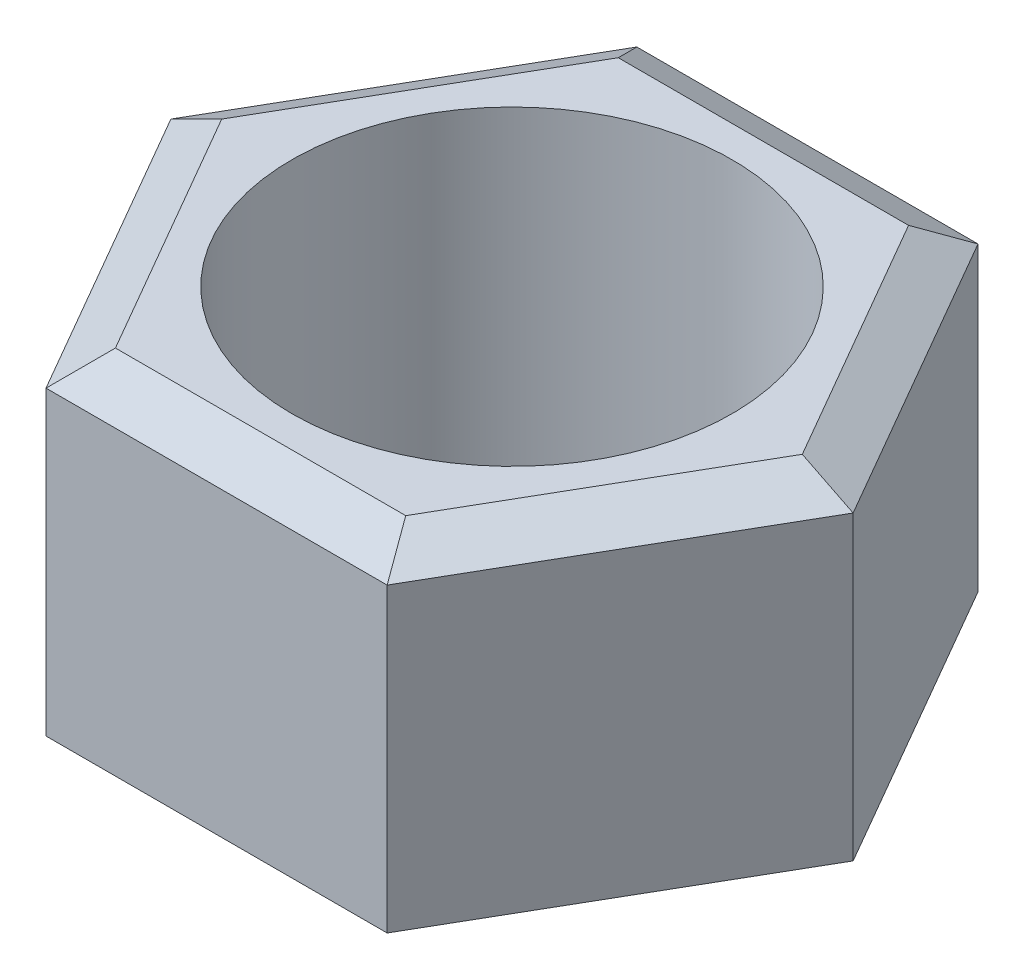
ISO-10303-21;
HEADER;
FILE_DESCRIPTION(('STEP AP214'),'2;1');
FILE_NAME('part.step','',(''),(''),'','','');
FILE_SCHEMA(('AUTOMOTIVE_DESIGN { 1 0 10303 214 1 1 1 1 }'));
ENDSEC;
DATA;
#1=APPLICATION_CONTEXT('core data for automotive mechanical design processes');
#2=APPLICATION_PROTOCOL_DEFINITION('international standard','automotive_design',2000,#1);
#3=PRODUCT_CONTEXT('',#1,'mechanical');
#4=PRODUCT('Part','Part','',(#3));
#5=PRODUCT_RELATED_PRODUCT_CATEGORY('part','',(#4));
#6=PRODUCT_DEFINITION_FORMATION('','',#4);
#7=PRODUCT_DEFINITION_CONTEXT('part definition',#1,'design');
#8=PRODUCT_DEFINITION('design','',#6,#7);
#9=PRODUCT_DEFINITION_SHAPE('','',#8);
#10=(LENGTH_UNIT() NAMED_UNIT(*) SI_UNIT(.MILLI.,.METRE.));
#11=(NAMED_UNIT(*) PLANE_ANGLE_UNIT() SI_UNIT($,.RADIAN.));
#12=(NAMED_UNIT(*) SI_UNIT($,.STERADIAN.) SOLID_ANGLE_UNIT());
#13=UNCERTAINTY_MEASURE_WITH_UNIT(LENGTH_MEASURE(1.E-05),#10,'distance_accuracy_value','');
#14=(GEOMETRIC_REPRESENTATION_CONTEXT(3) GLOBAL_UNCERTAINTY_ASSIGNED_CONTEXT((#13)) GLOBAL_UNIT_ASSIGNED_CONTEXT((#10,
#11,#12)) REPRESENTATION_CONTEXT('',''));
#15=CARTESIAN_POINT('',(0.,0.,0.));
#16=DIRECTION('',(0.,0.,1.));
#17=DIRECTION('',(1.,0.,0.));
#18=AXIS2_PLACEMENT_3D('',#15,#16,#17);
#19=CARTESIAN_POINT('',(0.,8.,0.));
#20=DIRECTION('',(0.,1.,0.));
#21=DIRECTION('',(0.,0.,1.));
#22=AXIS2_PLACEMENT_3D('',#19,#20,#21);
#23=PLANE('',#22);
#24=DIRECTION('',(0.5,0.,-0.866025403784439));
#25=VECTOR('',#24,1.);
#26=CARTESIAN_POINT('',(6.88397459621555,8.,-0.500000000000007));
#27=LINE('',#26,#25);
#28=CARTESIAN_POINT('',(3.29764973081037,8.,5.71169687932939));
#29=VERTEX_POINT('',#28);
#30=CARTESIAN_POINT('',(6.59529946162073,8.,0.));
#31=VERTEX_POINT('',#30);
#32=EDGE_CURVE('E130',#29,#31,#27,.T.);
#33=ORIENTED_EDGE('',*,*,#32,.T.);
#34=DIRECTION('',(-0.5,0.,-0.866025403784439));
#35=VECTOR('',#34,1.);
#36=CARTESIAN_POINT('',(3.00897459621555,8.,-6.21169687932939));
#37=LINE('',#36,#35);
#38=CARTESIAN_POINT('',(3.29764973081036,8.,-5.71169687932939));
#39=VERTEX_POINT('',#38);
#40=EDGE_CURVE('E163',#31,#39,#37,.T.);
#41=ORIENTED_EDGE('',*,*,#40,.T.);
#42=DIRECTION('',(-1.,0.,0.));
#43=VECTOR('',#42,1.);
#44=CARTESIAN_POINT('',(-3.875,8.,-5.71169687932939));
#45=LINE('',#44,#43);
#46=CARTESIAN_POINT('',(-3.29764973081037,8.,-5.71169687932939));
#47=VERTEX_POINT('',#46);
#48=EDGE_CURVE('E161',#39,#47,#45,.T.);
#49=ORIENTED_EDGE('',*,*,#48,.T.);
#50=DIRECTION('',(-0.5,0.,0.866025403784439));
#51=VECTOR('',#50,1.);
#52=CARTESIAN_POINT('',(-6.88397459621555,8.,0.500000000000006));
#53=LINE('',#52,#51);
#54=CARTESIAN_POINT('',(-6.59529946162074,8.,0.));
#55=VERTEX_POINT('',#54);
#56=EDGE_CURVE('E159',#47,#55,#53,.T.);
#57=ORIENTED_EDGE('',*,*,#56,.T.);
#58=DIRECTION('',(0.5,0.,0.866025403784439));
#59=VECTOR('',#58,1.);
#60=CARTESIAN_POINT('',(-3.00897459621555,8.,6.21169687932939));
#61=LINE('',#60,#59);
#62=CARTESIAN_POINT('',(-3.29764973081037,8.,5.71169687932939));
#63=VERTEX_POINT('',#62);
#64=EDGE_CURVE('E133',#55,#63,#61,.T.);
#65=ORIENTED_EDGE('',*,*,#64,.T.);
#66=DIRECTION('',(1.,0.,0.));
#67=VECTOR('',#66,1.);
#68=CARTESIAN_POINT('',(3.875,8.,5.71169687932939));
#69=LINE('',#68,#67);
#70=EDGE_CURVE('E125',#63,#29,#69,.T.);
#71=ORIENTED_EDGE('',*,*,#70,.T.);
#72=EDGE_LOOP('',(#33,#41,#49,#57,#65,#71));
#73=FACE_BOUND('',#72,.T.);
#74=CARTESIAN_POINT('',(0.,8.,0.));
#75=DIRECTION('',(0.,1.,0.));
#76=DIRECTION('',(0.,0.,1.));
#77=AXIS2_PLACEMENT_3D('',#74,#75,#76);
#78=CIRCLE('',#77,5.);
#79=CARTESIAN_POINT('',(0.,8.,5.));
#80=VERTEX_POINT('',#79);
#81=EDGE_CURVE('E254',#80,#80,#78,.T.);
#82=ORIENTED_EDGE('',*,*,#81,.F.);
#83=EDGE_LOOP('',(#82));
#84=FACE_BOUND('',#83,.T.);
#85=ADVANCED_FACE('F34',(#73,#84),#23,.T.);
#86=CARTESIAN_POINT('',(0.,0.,0.));
#87=DIRECTION('',(0.,1.,0.));
#88=DIRECTION('',(0.,0.,1.));
#89=AXIS2_PLACEMENT_3D('',#86,#87,#88);
#90=PLANE('',#89);
#91=DIRECTION('',(-0.5,0.,-0.866025403784439));
#92=VECTOR('',#91,1.);
#93=CARTESIAN_POINT('',(-4.94647459621555,0.,2.8558484396647));
#94=LINE('',#93,#92);
#95=CARTESIAN_POINT('',(-3.29764973081037,0.,5.71169687932939));
#96=VERTEX_POINT('',#95);
#97=CARTESIAN_POINT('',(-6.59529946162074,0.,0.));
#98=VERTEX_POINT('',#97);
#99=EDGE_CURVE('E198',#96,#98,#94,.T.);
#100=ORIENTED_EDGE('',*,*,#99,.T.);
#101=DIRECTION('',(0.5,0.,-0.866025403784439));
#102=VECTOR('',#101,1.);
#103=CARTESIAN_POINT('',(-4.94647459621555,0.,-2.85584843966469));
#104=LINE('',#103,#102);
#105=CARTESIAN_POINT('',(-3.29764973081037,0.,-5.71169687932939));
#106=VERTEX_POINT('',#105);
#107=EDGE_CURVE('E200',#98,#106,#104,.T.);
#108=ORIENTED_EDGE('',*,*,#107,.T.);
#109=DIRECTION('',(1.,0.,0.));
#110=VECTOR('',#109,1.);
#111=CARTESIAN_POINT('',(0.,0.,-5.71169687932939));
#112=LINE('',#111,#110);
#113=CARTESIAN_POINT('',(3.29764973081037,0.,-5.71169687932939));
#114=VERTEX_POINT('',#113);
#115=EDGE_CURVE('E190',#106,#114,#112,.T.);
#116=ORIENTED_EDGE('',*,*,#115,.T.);
#117=DIRECTION('',(0.5,0.,0.866025403784439));
#118=VECTOR('',#117,1.);
#119=CARTESIAN_POINT('',(4.94647459621555,0.,-2.8558484396647));
#120=LINE('',#119,#118);
#121=CARTESIAN_POINT('',(6.59529946162074,0.,0.));
#122=VERTEX_POINT('',#121);
#123=EDGE_CURVE('E192',#114,#122,#120,.T.);
#124=ORIENTED_EDGE('',*,*,#123,.T.);
#125=DIRECTION('',(-0.5,0.,0.866025403784439));
#126=VECTOR('',#125,1.);
#127=CARTESIAN_POINT('',(4.94647459621555,0.,2.85584843966469));
#128=LINE('',#127,#126);
#129=CARTESIAN_POINT('',(3.29764973081037,0.,5.71169687932939));
#130=VERTEX_POINT('',#129);
#131=EDGE_CURVE('E194',#122,#130,#128,.T.);
#132=ORIENTED_EDGE('',*,*,#131,.T.);
#133=DIRECTION('',(-1.,0.,0.));
#134=VECTOR('',#133,1.);
#135=CARTESIAN_POINT('',(0.,0.,5.71169687932939));
#136=LINE('',#135,#134);
#137=EDGE_CURVE('E196',#130,#96,#136,.T.);
#138=ORIENTED_EDGE('',*,*,#137,.T.);
#139=EDGE_LOOP('',(#100,#108,#116,#124,#132,#138));
#140=FACE_BOUND('',#139,.T.);
#141=CARTESIAN_POINT('',(0.,0.,0.));
#142=DIRECTION('',(0.,1.,0.));
#143=DIRECTION('',(0.,0.,1.));
#144=AXIS2_PLACEMENT_3D('',#141,#142,#143);
#145=CIRCLE('',#144,5.);
#146=CARTESIAN_POINT('',(0.,0.,5.));
#147=VERTEX_POINT('',#146);
#148=EDGE_CURVE('E187',#147,#147,#145,.T.);
#149=ORIENTED_EDGE('',*,*,#148,.T.);
#150=EDGE_LOOP('',(#149));
#151=FACE_BOUND('',#150,.T.);
#152=ADVANCED_FACE('F233',(#140,#151),#90,.F.);
#153=CARTESIAN_POINT('',(-3.875,8.,-6.7116968793294));
#154=DIRECTION('',(0.866025403784439,0.,0.5));
#155=DIRECTION('',(0.5,0.,-0.866025403784439));
#156=AXIS2_PLACEMENT_3D('',#153,#154,#155);
#157=PLANE('',#156);
#158=DIRECTION('',(0.,-1.,0.));
#159=VECTOR('',#158,1.);
#160=CARTESIAN_POINT('',(-3.875,8.,-6.7116968793294));
#161=LINE('',#160,#159);
#162=CARTESIAN_POINT('',(-3.875,7.42264973081037,-6.7116968793294));
#163=VERTEX_POINT('',#162);
#164=CARTESIAN_POINT('',(-3.875,0.577350269189626,-6.7116968793294));
#165=VERTEX_POINT('',#164);
#166=EDGE_CURVE('E247',#163,#165,#161,.T.);
#167=ORIENTED_EDGE('',*,*,#166,.T.);
#168=DIRECTION('',(-0.5,0.,0.866025403784439));
#169=VECTOR('',#168,1.);
#170=CARTESIAN_POINT('',(-3.875,0.577350269189626,-6.7116968793294));
#171=LINE('',#170,#169);
#172=CARTESIAN_POINT('',(-7.75,0.577350269189626,0.));
#173=VERTEX_POINT('',#172);
#174=EDGE_CURVE('E177',#165,#173,#171,.T.);
#175=ORIENTED_EDGE('',*,*,#174,.T.);
#176=DIRECTION('',(0.,-1.,0.));
#177=VECTOR('',#176,1.);
#178=CARTESIAN_POINT('',(-7.75,8.,0.));
#179=LINE('',#178,#177);
#180=CARTESIAN_POINT('',(-7.75,7.42264973081037,0.));
#181=VERTEX_POINT('',#180);
#182=EDGE_CURVE('E151',#181,#173,#179,.T.);
#183=ORIENTED_EDGE('',*,*,#182,.F.);
#184=DIRECTION('',(0.5,0.,-0.866025403784439));
#185=VECTOR('',#184,1.);
#186=CARTESIAN_POINT('',(-3.875,7.42264973081037,-6.7116968793294));
#187=LINE('',#186,#185);
#188=EDGE_CURVE('E170',#181,#163,#187,.T.);
#189=ORIENTED_EDGE('',*,*,#188,.T.);
#190=EDGE_LOOP('',(#167,#175,#183,#189));
#191=FACE_BOUND('',#190,.T.);
#192=ADVANCED_FACE('F251',(#191),#157,.F.);
#193=CARTESIAN_POINT('',(-7.75,8.,0.));
#194=DIRECTION('',(0.866025403784439,0.,-0.5));
#195=DIRECTION('',(-0.5,0.,-0.866025403784439));
#196=AXIS2_PLACEMENT_3D('',#193,#194,#195);
#197=PLANE('',#196);
#198=ORIENTED_EDGE('',*,*,#182,.T.);
#199=DIRECTION('',(0.5,0.,0.866025403784439));
#200=VECTOR('',#199,1.);
#201=CARTESIAN_POINT('',(-7.75,0.577350269189626,0.));
#202=LINE('',#201,#200);
#203=CARTESIAN_POINT('',(-3.875,0.577350269189626,6.7116968793294));
#204=VERTEX_POINT('',#203);
#205=EDGE_CURVE('E203',#173,#204,#202,.T.);
#206=ORIENTED_EDGE('',*,*,#205,.T.);
#207=DIRECTION('',(0.,-1.,0.));
#208=VECTOR('',#207,1.);
#209=CARTESIAN_POINT('',(-3.875,8.,6.7116968793294));
#210=LINE('',#209,#208);
#211=CARTESIAN_POINT('',(-3.875,7.42264973081037,6.7116968793294));
#212=VERTEX_POINT('',#211);
#213=EDGE_CURVE('E154',#212,#204,#210,.T.);
#214=ORIENTED_EDGE('',*,*,#213,.F.);
#215=DIRECTION('',(-0.5,0.,-0.866025403784439));
#216=VECTOR('',#215,1.);
#217=CARTESIAN_POINT('',(-7.75,7.42264973081037,0.));
#218=LINE('',#217,#216);
#219=EDGE_CURVE('E172',#212,#181,#218,.T.);
#220=ORIENTED_EDGE('',*,*,#219,.T.);
#221=EDGE_LOOP('',(#198,#206,#214,#220));
#222=FACE_BOUND('',#221,.T.);
#223=ADVANCED_FACE('F305',(#222),#197,.F.);
#224=CARTESIAN_POINT('',(-3.875,8.,6.7116968793294));
#225=DIRECTION('',(0.,0.,-1.));
#226=DIRECTION('',(-1.,0.,0.));
#227=AXIS2_PLACEMENT_3D('',#224,#225,#226);
#228=PLANE('',#227);
#229=ORIENTED_EDGE('',*,*,#213,.T.);
#230=DIRECTION('',(1.,0.,0.));
#231=VECTOR('',#230,1.);
#232=CARTESIAN_POINT('',(-3.875,0.577350269189626,6.7116968793294));
#233=LINE('',#232,#231);
#234=CARTESIAN_POINT('',(3.875,0.577350269189626,6.7116968793294));
#235=VERTEX_POINT('',#234);
#236=EDGE_CURVE('E205',#204,#235,#233,.T.);
#237=ORIENTED_EDGE('',*,*,#236,.T.);
#238=DIRECTION('',(0.,-1.,0.));
#239=VECTOR('',#238,1.);
#240=CARTESIAN_POINT('',(3.875,8.,6.7116968793294));
#241=LINE('',#240,#239);
#242=CARTESIAN_POINT('',(3.875,7.42264973081037,6.7116968793294));
#243=VERTEX_POINT('',#242);
#244=EDGE_CURVE('E263',#243,#235,#241,.T.);
#245=ORIENTED_EDGE('',*,*,#244,.F.);
#246=DIRECTION('',(-1.,0.,0.));
#247=VECTOR('',#246,1.);
#248=CARTESIAN_POINT('',(-3.875,7.42264973081037,6.7116968793294));
#249=LINE('',#248,#247);
#250=EDGE_CURVE('E142',#243,#212,#249,.T.);
#251=ORIENTED_EDGE('',*,*,#250,.T.);
#252=EDGE_LOOP('',(#229,#237,#245,#251));
#253=FACE_BOUND('',#252,.T.);
#254=ADVANCED_FACE('F267',(#253),#228,.F.);
#255=CARTESIAN_POINT('',(3.875,8.,6.7116968793294));
#256=DIRECTION('',(-0.866025403784439,0.,-0.5));
#257=DIRECTION('',(-0.5,0.,0.866025403784439));
#258=AXIS2_PLACEMENT_3D('',#255,#256,#257);
#259=PLANE('',#258);
#260=ORIENTED_EDGE('',*,*,#244,.T.);
#261=DIRECTION('',(0.5,0.,-0.866025403784439));
#262=VECTOR('',#261,1.);
#263=CARTESIAN_POINT('',(3.875,0.577350269189626,6.7116968793294));
#264=LINE('',#263,#262);
#265=CARTESIAN_POINT('',(7.75,0.577350269189626,0.));
#266=VERTEX_POINT('',#265);
#267=EDGE_CURVE('E58',#235,#266,#264,.T.);
#268=ORIENTED_EDGE('',*,*,#267,.T.);
#269=DIRECTION('',(0.,-1.,0.));
#270=VECTOR('',#269,1.);
#271=CARTESIAN_POINT('',(7.75,8.,0.));
#272=LINE('',#271,#270);
#273=CARTESIAN_POINT('',(7.75,7.42264973081037,0.));
#274=VERTEX_POINT('',#273);
#275=EDGE_CURVE('E256',#274,#266,#272,.T.);
#276=ORIENTED_EDGE('',*,*,#275,.F.);
#277=DIRECTION('',(-0.5,0.,0.866025403784439));
#278=VECTOR('',#277,1.);
#279=CARTESIAN_POINT('',(3.875,7.42264973081037,6.7116968793294));
#280=LINE('',#279,#278);
#281=EDGE_CURVE('E175',#274,#243,#280,.T.);
#282=ORIENTED_EDGE('',*,*,#281,.T.);
#283=EDGE_LOOP('',(#260,#268,#276,#282));
#284=FACE_BOUND('',#283,.T.);
#285=ADVANCED_FACE('F300',(#284),#259,.F.);
#286=CARTESIAN_POINT('',(7.75,8.,0.));
#287=DIRECTION('',(-0.866025403784438,0.,0.5));
#288=DIRECTION('',(0.5,0.,0.866025403784439));
#289=AXIS2_PLACEMENT_3D('',#286,#287,#288);
#290=PLANE('',#289);
#291=ORIENTED_EDGE('',*,*,#275,.T.);
#292=DIRECTION('',(-0.5,0.,-0.866025403784439));
#293=VECTOR('',#292,1.);
#294=CARTESIAN_POINT('',(7.75,0.577350269189626,0.));
#295=LINE('',#294,#293);
#296=CARTESIAN_POINT('',(3.875,0.577350269189626,-6.7116968793294));
#297=VERTEX_POINT('',#296);
#298=EDGE_CURVE('E43',#266,#297,#295,.T.);
#299=ORIENTED_EDGE('',*,*,#298,.T.);
#300=DIRECTION('',(0.,-1.,0.));
#301=VECTOR('',#300,1.);
#302=CARTESIAN_POINT('',(3.875,8.,-6.7116968793294));
#303=LINE('',#302,#301);
#304=CARTESIAN_POINT('',(3.875,7.42264973081037,-6.7116968793294));
#305=VERTEX_POINT('',#304);
#306=EDGE_CURVE('E249',#305,#297,#303,.T.);
#307=ORIENTED_EDGE('',*,*,#306,.F.);
#308=DIRECTION('',(0.5,0.,0.866025403784439));
#309=VECTOR('',#308,1.);
#310=CARTESIAN_POINT('',(7.75,7.42264973081037,0.));
#311=LINE('',#310,#309);
#312=EDGE_CURVE('E165',#305,#274,#311,.T.);
#313=ORIENTED_EDGE('',*,*,#312,.T.);
#314=EDGE_LOOP('',(#291,#299,#307,#313));
#315=FACE_BOUND('',#314,.T.);
#316=ADVANCED_FACE('F297',(#315),#290,.F.);
#317=CARTESIAN_POINT('',(3.875,8.,-6.7116968793294));
#318=DIRECTION('',(0.,0.,1.));
#319=DIRECTION('',(1.,0.,0.));
#320=AXIS2_PLACEMENT_3D('',#317,#318,#319);
#321=PLANE('',#320);
#322=ORIENTED_EDGE('',*,*,#306,.T.);
#323=DIRECTION('',(-1.,0.,0.));
#324=VECTOR('',#323,1.);
#325=CARTESIAN_POINT('',(3.875,0.577350269189626,-6.7116968793294));
#326=LINE('',#325,#324);
#327=EDGE_CURVE('E11',#297,#165,#326,.T.);
#328=ORIENTED_EDGE('',*,*,#327,.T.);
#329=ORIENTED_EDGE('',*,*,#166,.F.);
#330=DIRECTION('',(1.,0.,0.));
#331=VECTOR('',#330,1.);
#332=CARTESIAN_POINT('',(3.875,7.42264973081037,-6.7116968793294));
#333=LINE('',#332,#331);
#334=EDGE_CURVE('E168',#163,#305,#333,.T.);
#335=ORIENTED_EDGE('',*,*,#334,.T.);
#336=EDGE_LOOP('',(#322,#328,#329,#335));
#337=FACE_BOUND('',#336,.T.);
#338=ADVANCED_FACE('F246',(#337),#321,.F.);
#339=CARTESIAN_POINT('',(0.,8.,0.));
#340=DIRECTION('',(0.,-1.,0.));
#341=DIRECTION('',(0.,0.,-1.));
#342=AXIS2_PLACEMENT_3D('',#339,#340,#341);
#343=CYLINDRICAL_SURFACE('',#342,5.);
#344=ORIENTED_EDGE('',*,*,#81,.T.);
#345=EDGE_LOOP('',(#344));
#346=FACE_BOUND('',#345,.T.);
#347=ORIENTED_EDGE('',*,*,#148,.F.);
#348=EDGE_LOOP('',(#347));
#349=FACE_BOUND('',#348,.T.);
#350=ADVANCED_FACE('F293',(#346,#349),#343,.F.);
#351=CARTESIAN_POINT('',(-4.94647459621555,8.,2.8558484396647));
#352=DIRECTION('',(-0.433012701892219,0.866025403784439,0.25));
#353=DIRECTION('',(-0.5,0.,-0.866025403784439));
#354=AXIS2_PLACEMENT_3D('',#351,#352,#353);
#355=PLANE('',#354);
#356=DIRECTION('',(-0.894427190999916,-0.447213595499957,0.));
#357=VECTOR('',#356,1.);
#358=CARTESIAN_POINT('',(-5.27623956929659,8.65952994616207,0.));
#359=LINE('',#358,#357);
#360=EDGE_CURVE('E145',#181,#55,#359,.F.);
#361=ORIENTED_EDGE('',*,*,#360,.F.);
#362=ORIENTED_EDGE('',*,*,#219,.F.);
#363=DIRECTION('',(-0.447213595499958,-0.447213595499957,0.774596669241484));
#364=VECTOR('',#363,1.);
#365=CARTESIAN_POINT('',(-2.63811978464829,8.65952994616207,4.56935750346351));
#366=LINE('',#365,#364);
#367=EDGE_CURVE('E185',#63,#212,#366,.T.);
#368=ORIENTED_EDGE('',*,*,#367,.F.);
#369=ORIENTED_EDGE('',*,*,#64,.F.);
#370=EDGE_LOOP('',(#361,#362,#368,#369));
#371=FACE_BOUND('',#370,.T.);
#372=ADVANCED_FACE('F325',(#371),#355,.T.);
#373=CARTESIAN_POINT('',(0.,8.,5.71169687932939));
#374=DIRECTION('',(0.,0.866025403784439,0.499999999999999));
#375=DIRECTION('',(-1.,0.,0.));
#376=AXIS2_PLACEMENT_3D('',#373,#374,#375);
#377=PLANE('',#376);
#378=ORIENTED_EDGE('',*,*,#367,.T.);
#379=ORIENTED_EDGE('',*,*,#250,.F.);
#380=DIRECTION('',(0.447213595499958,-0.447213595499957,0.774596669241484));
#381=VECTOR('',#380,1.);
#382=CARTESIAN_POINT('',(2.63811978464829,8.65952994616207,4.56935750346351));
#383=LINE('',#382,#381);
#384=EDGE_CURVE('E140',#29,#243,#383,.T.);
#385=ORIENTED_EDGE('',*,*,#384,.F.);
#386=ORIENTED_EDGE('',*,*,#70,.F.);
#387=EDGE_LOOP('',(#378,#379,#385,#386));
#388=FACE_BOUND('',#387,.T.);
#389=ADVANCED_FACE('F141',(#388),#377,.T.);
#390=CARTESIAN_POINT('',(-4.94647459621555,8.,-2.85584843966469));
#391=DIRECTION('',(-0.433012701892219,0.866025403784439,-0.249999999999999));
#392=DIRECTION('',(0.5,0.,-0.866025403784439));
#393=AXIS2_PLACEMENT_3D('',#390,#391,#392);
#394=PLANE('',#393);
#395=ORIENTED_EDGE('',*,*,#360,.T.);
#396=ORIENTED_EDGE('',*,*,#56,.F.);
#397=DIRECTION('',(-0.447213595499959,-0.447213595499957,-0.774596669241483));
#398=VECTOR('',#397,1.);
#399=CARTESIAN_POINT('',(-2.63811978464829,8.65952994616207,-4.56935750346351));
#400=LINE('',#399,#398);
#401=EDGE_CURVE('E146',#163,#47,#400,.F.);
#402=ORIENTED_EDGE('',*,*,#401,.F.);
#403=ORIENTED_EDGE('',*,*,#188,.F.);
#404=EDGE_LOOP('',(#395,#396,#402,#403));
#405=FACE_BOUND('',#404,.T.);
#406=ADVANCED_FACE('F320',(#405),#394,.T.);
#407=CARTESIAN_POINT('',(4.94647459621555,8.,2.85584843966469));
#408=DIRECTION('',(0.433012701892219,0.866025403784439,0.25));
#409=DIRECTION('',(-0.5,0.,0.866025403784439));
#410=AXIS2_PLACEMENT_3D('',#407,#408,#409);
#411=PLANE('',#410);
#412=ORIENTED_EDGE('',*,*,#384,.T.);
#413=ORIENTED_EDGE('',*,*,#281,.F.);
#414=DIRECTION('',(-0.894427190999916,0.447213595499957,0.));
#415=VECTOR('',#414,1.);
#416=CARTESIAN_POINT('',(5.27623956929659,8.65952994616207,0.));
#417=LINE('',#416,#415);
#418=EDGE_CURVE('E149',#31,#274,#417,.F.);
#419=ORIENTED_EDGE('',*,*,#418,.F.);
#420=ORIENTED_EDGE('',*,*,#32,.F.);
#421=EDGE_LOOP('',(#412,#413,#419,#420));
#422=FACE_BOUND('',#421,.T.);
#423=ADVANCED_FACE('F148',(#422),#411,.T.);
#424=CARTESIAN_POINT('',(0.,8.,-5.71169687932939));
#425=DIRECTION('',(0.,0.866025403784439,-0.499999999999999));
#426=DIRECTION('',(1.,0.,0.));
#427=AXIS2_PLACEMENT_3D('',#424,#425,#426);
#428=PLANE('',#427);
#429=ORIENTED_EDGE('',*,*,#401,.T.);
#430=ORIENTED_EDGE('',*,*,#48,.F.);
#431=DIRECTION('',(0.447213595499958,-0.447213595499957,-0.774596669241484));
#432=VECTOR('',#431,1.);
#433=CARTESIAN_POINT('',(2.63811978464829,8.65952994616207,-4.56935750346351));
#434=LINE('',#433,#432);
#435=EDGE_CURVE('E178',#305,#39,#434,.F.);
#436=ORIENTED_EDGE('',*,*,#435,.F.);
#437=ORIENTED_EDGE('',*,*,#334,.F.);
#438=EDGE_LOOP('',(#429,#430,#436,#437));
#439=FACE_BOUND('',#438,.T.);
#440=ADVANCED_FACE('F313',(#439),#428,.T.);
#441=CARTESIAN_POINT('',(4.94647459621555,8.,-2.85584843966469));
#442=DIRECTION('',(0.433012701892219,0.866025403784439,-0.25));
#443=DIRECTION('',(0.5,0.,0.866025403784439));
#444=AXIS2_PLACEMENT_3D('',#441,#442,#443);
#445=PLANE('',#444);
#446=ORIENTED_EDGE('',*,*,#418,.T.);
#447=ORIENTED_EDGE('',*,*,#312,.F.);
#448=ORIENTED_EDGE('',*,*,#435,.T.);
#449=ORIENTED_EDGE('',*,*,#40,.F.);
#450=EDGE_LOOP('',(#446,#447,#448,#449));
#451=FACE_BOUND('',#450,.T.);
#452=ADVANCED_FACE('F310',(#451),#445,.T.);
#453=CARTESIAN_POINT('',(3.875,0.577350269189626,6.7116968793294));
#454=DIRECTION('',(-0.433012701892217,0.86602540378444,-0.249999999999999));
#455=DIRECTION('',(0.5,0.,-0.866025403784439));
#456=AXIS2_PLACEMENT_3D('',#453,#454,#455);
#457=PLANE('',#456);
#458=DIRECTION('',(-0.447213595499959,-0.447213595499955,-0.774596669241484));
#459=VECTOR('',#458,1.);
#460=CARTESIAN_POINT('',(3.875,0.577350269189626,6.7116968793294));
#461=LINE('',#460,#459);
#462=EDGE_CURVE('E218',#130,#235,#461,.F.);
#463=ORIENTED_EDGE('',*,*,#462,.F.);
#464=ORIENTED_EDGE('',*,*,#131,.F.);
#465=DIRECTION('',(-0.894427190999917,-0.447213595499955,0.));
#466=VECTOR('',#465,1.);
#467=CARTESIAN_POINT('',(7.75,0.577350269189626,0.));
#468=LINE('',#467,#466);
#469=EDGE_CURVE('E38',#266,#122,#468,.T.);
#470=ORIENTED_EDGE('',*,*,#469,.F.);
#471=ORIENTED_EDGE('',*,*,#267,.F.);
#472=EDGE_LOOP('',(#463,#464,#470,#471));
#473=FACE_BOUND('',#472,.T.);
#474=ADVANCED_FACE('F36',(#473),#457,.F.);
#475=CARTESIAN_POINT('',(7.75,0.577350269189626,0.));
#476=DIRECTION('',(-0.433012701892217,0.86602540378444,0.249999999999999));
#477=DIRECTION('',(-0.5,0.,-0.866025403784439));
#478=AXIS2_PLACEMENT_3D('',#475,#476,#477);
#479=PLANE('',#478);
#480=ORIENTED_EDGE('',*,*,#469,.T.);
#481=ORIENTED_EDGE('',*,*,#123,.F.);
#482=DIRECTION('',(-0.447213595499959,-0.447213595499955,0.774596669241484));
#483=VECTOR('',#482,1.);
#484=CARTESIAN_POINT('',(3.875,0.577350269189626,-6.7116968793294));
#485=LINE('',#484,#483);
#486=EDGE_CURVE('E216',#297,#114,#485,.T.);
#487=ORIENTED_EDGE('',*,*,#486,.F.);
#488=ORIENTED_EDGE('',*,*,#298,.F.);
#489=EDGE_LOOP('',(#480,#481,#487,#488));
#490=FACE_BOUND('',#489,.T.);
#491=ADVANCED_FACE('F228',(#490),#479,.F.);
#492=CARTESIAN_POINT('',(-3.875,0.577350269189626,6.7116968793294));
#493=DIRECTION('',(0.,0.86602540378444,-0.499999999999998));
#494=DIRECTION('',(1.,0.,0.));
#495=AXIS2_PLACEMENT_3D('',#492,#493,#494);
#496=PLANE('',#495);
#497=ORIENTED_EDGE('',*,*,#462,.T.);
#498=ORIENTED_EDGE('',*,*,#236,.F.);
#499=DIRECTION('',(0.447213595499959,-0.447213595499956,-0.774596669241484));
#500=VECTOR('',#499,1.);
#501=CARTESIAN_POINT('',(-3.875,0.577350269189626,6.7116968793294));
#502=LINE('',#501,#500);
#503=EDGE_CURVE('E213',#96,#204,#502,.F.);
#504=ORIENTED_EDGE('',*,*,#503,.F.);
#505=ORIENTED_EDGE('',*,*,#137,.F.);
#506=EDGE_LOOP('',(#497,#498,#504,#505));
#507=FACE_BOUND('',#506,.T.);
#508=ADVANCED_FACE('F271',(#507),#496,.F.);
#509=CARTESIAN_POINT('',(3.875,0.577350269189626,-6.7116968793294));
#510=DIRECTION('',(0.,0.86602540378444,0.499999999999997));
#511=DIRECTION('',(-1.,0.,0.));
#512=AXIS2_PLACEMENT_3D('',#509,#510,#511);
#513=PLANE('',#512);
#514=ORIENTED_EDGE('',*,*,#486,.T.);
#515=ORIENTED_EDGE('',*,*,#115,.F.);
#516=DIRECTION('',(-0.447213595499958,0.447213595499955,-0.774596669241485));
#517=VECTOR('',#516,1.);
#518=CARTESIAN_POINT('',(-2.325,-0.972649730810365,-4.02701812759763));
#519=LINE('',#518,#517);
#520=EDGE_CURVE('E211',#165,#106,#519,.F.);
#521=ORIENTED_EDGE('',*,*,#520,.F.);
#522=ORIENTED_EDGE('',*,*,#327,.F.);
#523=EDGE_LOOP('',(#514,#515,#521,#522));
#524=FACE_BOUND('',#523,.T.);
#525=ADVANCED_FACE('F240',(#524),#513,.F.);
#526=CARTESIAN_POINT('',(-7.75,0.577350269189626,0.));
#527=DIRECTION('',(0.433012701892217,0.86602540378444,-0.249999999999999));
#528=DIRECTION('',(0.5,0.,0.866025403784439));
#529=AXIS2_PLACEMENT_3D('',#526,#527,#528);
#530=PLANE('',#529);
#531=ORIENTED_EDGE('',*,*,#503,.T.);
#532=ORIENTED_EDGE('',*,*,#205,.F.);
#533=DIRECTION('',(0.894427190999917,-0.447213595499956,0.));
#534=VECTOR('',#533,1.);
#535=CARTESIAN_POINT('',(-7.75,0.577350269189626,0.));
#536=LINE('',#535,#534);
#537=EDGE_CURVE('E209',#98,#173,#536,.F.);
#538=ORIENTED_EDGE('',*,*,#537,.F.);
#539=ORIENTED_EDGE('',*,*,#99,.F.);
#540=EDGE_LOOP('',(#531,#532,#538,#539));
#541=FACE_BOUND('',#540,.T.);
#542=ADVANCED_FACE('F275',(#541),#530,.F.);
#543=CARTESIAN_POINT('',(-3.875,0.577350269189626,-6.7116968793294));
#544=DIRECTION('',(0.433012701892217,0.86602540378444,0.249999999999999));
#545=DIRECTION('',(-0.5,0.,0.866025403784439));
#546=AXIS2_PLACEMENT_3D('',#543,#544,#545);
#547=PLANE('',#546);
#548=ORIENTED_EDGE('',*,*,#520,.T.);
#549=ORIENTED_EDGE('',*,*,#107,.F.);
#550=ORIENTED_EDGE('',*,*,#537,.T.);
#551=ORIENTED_EDGE('',*,*,#174,.F.);
#552=EDGE_LOOP('',(#548,#549,#550,#551));
#553=FACE_BOUND('',#552,.T.);
#554=ADVANCED_FACE('F278',(#553),#547,.F.);
#555=CLOSED_SHELL('',(#85,#152,#192,#223,#254,#285,#316,#338,#350,#372,#389,#406,#423,#440,#452,
#474,#491,#508,#525,#542,#554));
#556=MANIFOLD_SOLID_BREP('B2',#555);
#557=ADVANCED_BREP_SHAPE_REPRESENTATION('',(#18,#556),#14);
#558=SHAPE_DEFINITION_REPRESENTATION(#9,#557);
ENDSEC;
END-ISO-10303-21;
